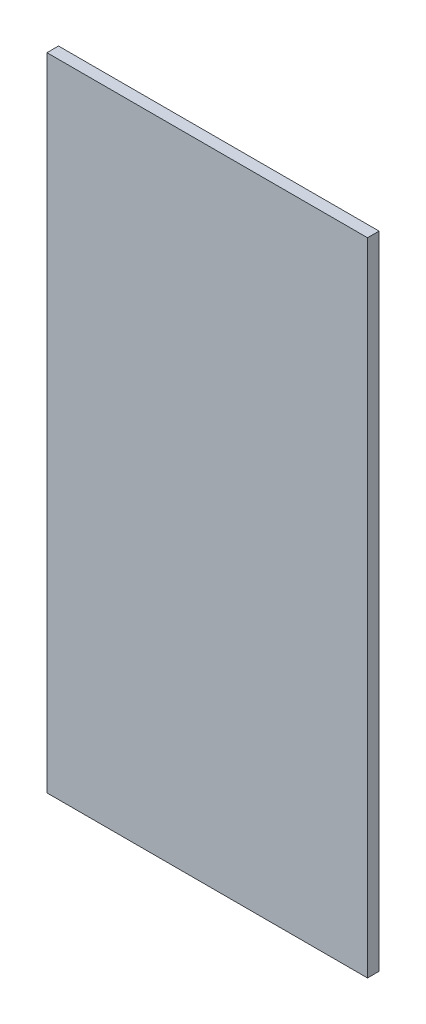
ISO-10303-21;
HEADER;
FILE_DESCRIPTION(('STEP AP214'),'2;1');
FILE_NAME('part.step','',(''),(''),'','','');
FILE_SCHEMA(('AUTOMOTIVE_DESIGN { 1 0 10303 214 1 1 1 1 }'));
ENDSEC;
DATA;
#1=APPLICATION_CONTEXT('core data for automotive mechanical design processes');
#2=APPLICATION_PROTOCOL_DEFINITION('international standard','automotive_design',2000,#1);
#3=PRODUCT_CONTEXT('',#1,'mechanical');
#4=PRODUCT('Part','Part','',(#3));
#5=PRODUCT_RELATED_PRODUCT_CATEGORY('part','',(#4));
#6=PRODUCT_DEFINITION_FORMATION('','',#4);
#7=PRODUCT_DEFINITION_CONTEXT('part definition',#1,'design');
#8=PRODUCT_DEFINITION('design','',#6,#7);
#9=PRODUCT_DEFINITION_SHAPE('','',#8);
#10=(LENGTH_UNIT() NAMED_UNIT(*) SI_UNIT(.MILLI.,.METRE.));
#11=(NAMED_UNIT(*) PLANE_ANGLE_UNIT() SI_UNIT($,.RADIAN.));
#12=(NAMED_UNIT(*) SI_UNIT($,.STERADIAN.) SOLID_ANGLE_UNIT());
#13=UNCERTAINTY_MEASURE_WITH_UNIT(LENGTH_MEASURE(1.E-05),#10,'distance_accuracy_value','');
#14=(GEOMETRIC_REPRESENTATION_CONTEXT(3) GLOBAL_UNCERTAINTY_ASSIGNED_CONTEXT((#13)) GLOBAL_UNIT_ASSIGNED_CONTEXT((#10,
#11,#12)) REPRESENTATION_CONTEXT('',''));
#15=CARTESIAN_POINT('',(0.,0.,0.));
#16=DIRECTION('',(0.,0.,1.));
#17=DIRECTION('',(1.,0.,0.));
#18=AXIS2_PLACEMENT_3D('',#15,#16,#17);
#19=CARTESIAN_POINT('',(-0.375,0.5,-0.018));
#20=DIRECTION('',(1.,0.,0.));
#21=DIRECTION('',(0.,0.,1.));
#22=AXIS2_PLACEMENT_3D('',#19,#20,#21);
#23=PLANE('',#22);
#24=CARTESIAN_POINT('',(-0.375,0.5,-0.018));
#25=CARTESIAN_POINT('',(-0.375,1.5,-0.018));
#26=B_SPLINE_CURVE_WITH_KNOTS('',1,(#24,#25),.UNSPECIFIED.,.F.,.F.,(2,2),(0.,1.),.UNSPECIFIED.);
#27=CARTESIAN_POINT('',(-0.375,0.5,-0.018));
#28=VERTEX_POINT('',#27);
#29=CARTESIAN_POINT('',(-0.375,1.5,-0.018));
#30=VERTEX_POINT('',#29);
#31=EDGE_CURVE('E11',#28,#30,#26,.T.);
#32=ORIENTED_EDGE('',*,*,#31,.T.);
#33=CARTESIAN_POINT('',(-0.375,1.5,-0.018));
#34=CARTESIAN_POINT('',(-0.375,1.5,0.));
#35=B_SPLINE_CURVE_WITH_KNOTS('',1,(#33,#34),.UNSPECIFIED.,.F.,.F.,(2,2),(0.,0.018),.UNSPECIFIED.);
#36=CARTESIAN_POINT('',(-0.375,1.5,0.));
#37=VERTEX_POINT('',#36);
#38=EDGE_CURVE('E26',#30,#37,#35,.T.);
#39=ORIENTED_EDGE('',*,*,#38,.T.);
#40=CARTESIAN_POINT('',(-0.375,0.5,0.));
#41=CARTESIAN_POINT('',(-0.375,1.5,0.));
#42=B_SPLINE_CURVE_WITH_KNOTS('',1,(#40,#41),.UNSPECIFIED.,.F.,.F.,(2,2),(0.,1.),.UNSPECIFIED.);
#43=CARTESIAN_POINT('',(-0.375,0.5,0.));
#44=VERTEX_POINT('',#43);
#45=EDGE_CURVE('E132',#44,#37,#42,.T.);
#46=ORIENTED_EDGE('',*,*,#45,.F.);
#47=CARTESIAN_POINT('',(-0.375,0.5,-0.018));
#48=CARTESIAN_POINT('',(-0.375,0.5,0.));
#49=B_SPLINE_CURVE_WITH_KNOTS('',1,(#47,#48),.UNSPECIFIED.,.F.,.F.,(2,2),(0.,0.018),.UNSPECIFIED.);
#50=EDGE_CURVE('E79',#28,#44,#49,.T.);
#51=ORIENTED_EDGE('',*,*,#50,.F.);
#52=EDGE_LOOP('',(#32,#39,#46,#51));
#53=FACE_BOUND('',#52,.T.);
#54=ADVANCED_FACE('F17',(#53),#23,.T.);
#55=CARTESIAN_POINT('',(-0.375,1.5,-0.018));
#56=DIRECTION('',(0.,1.,0.));
#57=DIRECTION('',(0.,0.,1.));
#58=AXIS2_PLACEMENT_3D('',#55,#56,#57);
#59=PLANE('',#58);
#60=CARTESIAN_POINT('',(-0.375,1.5,-0.018));
#61=CARTESIAN_POINT('',(-0.875,1.5,-0.018));
#62=B_SPLINE_CURVE_WITH_KNOTS('',1,(#60,#61),.UNSPECIFIED.,.F.,.F.,(2,2),(1.,1.5),.UNSPECIFIED.);
#63=CARTESIAN_POINT('',(-0.875,1.5,-0.018));
#64=VERTEX_POINT('',#63);
#65=EDGE_CURVE('E119',#30,#64,#62,.T.);
#66=ORIENTED_EDGE('',*,*,#65,.T.);
#67=CARTESIAN_POINT('',(-0.875,1.5,-0.018));
#68=CARTESIAN_POINT('',(-0.875,1.5,0.));
#69=B_SPLINE_CURVE_WITH_KNOTS('',1,(#67,#68),.UNSPECIFIED.,.F.,.F.,(2,2),(0.,0.018),.UNSPECIFIED.);
#70=CARTESIAN_POINT('',(-0.875,1.5,0.));
#71=VERTEX_POINT('',#70);
#72=EDGE_CURVE('E112',#64,#71,#69,.T.);
#73=ORIENTED_EDGE('',*,*,#72,.T.);
#74=CARTESIAN_POINT('',(-0.375,1.5,0.));
#75=CARTESIAN_POINT('',(-0.875,1.5,0.));
#76=B_SPLINE_CURVE_WITH_KNOTS('',1,(#74,#75),.UNSPECIFIED.,.F.,.F.,(2,2),(1.,1.5),.UNSPECIFIED.);
#77=EDGE_CURVE('E74',#37,#71,#76,.T.);
#78=ORIENTED_EDGE('',*,*,#77,.F.);
#79=ORIENTED_EDGE('',*,*,#38,.F.);
#80=EDGE_LOOP('',(#66,#73,#78,#79));
#81=FACE_BOUND('',#80,.T.);
#82=ADVANCED_FACE('F147',(#81),#59,.T.);
#83=CARTESIAN_POINT('',(-0.875,1.5,-0.018));
#84=DIRECTION('',(-1.,0.,0.));
#85=DIRECTION('',(0.,0.,-1.));
#86=AXIS2_PLACEMENT_3D('',#83,#84,#85);
#87=PLANE('',#86);
#88=CARTESIAN_POINT('',(-0.875,1.5,-0.018));
#89=CARTESIAN_POINT('',(-0.875,0.5,-0.018));
#90=B_SPLINE_CURVE_WITH_KNOTS('',1,(#88,#89),.UNSPECIFIED.,.F.,.F.,(2,2),(1.5,2.5),.UNSPECIFIED.);
#91=CARTESIAN_POINT('',(-0.875,0.5,-0.018));
#92=VERTEX_POINT('',#91);
#93=EDGE_CURVE('E62',#64,#92,#90,.T.);
#94=ORIENTED_EDGE('',*,*,#93,.T.);
#95=CARTESIAN_POINT('',(-0.875,0.5,-0.018));
#96=CARTESIAN_POINT('',(-0.875,0.5,0.));
#97=B_SPLINE_CURVE_WITH_KNOTS('',1,(#95,#96),.UNSPECIFIED.,.F.,.F.,(2,2),(0.,0.018),.UNSPECIFIED.);
#98=CARTESIAN_POINT('',(-0.875,0.5,0.));
#99=VERTEX_POINT('',#98);
#100=EDGE_CURVE('E56',#92,#99,#97,.T.);
#101=ORIENTED_EDGE('',*,*,#100,.T.);
#102=CARTESIAN_POINT('',(-0.875,1.5,0.));
#103=CARTESIAN_POINT('',(-0.875,0.5,0.));
#104=B_SPLINE_CURVE_WITH_KNOTS('',1,(#102,#103),.UNSPECIFIED.,.F.,.F.,(2,2),(1.5,2.5),.UNSPECIFIED.);
#105=EDGE_CURVE('E60',#71,#99,#104,.T.);
#106=ORIENTED_EDGE('',*,*,#105,.F.);
#107=ORIENTED_EDGE('',*,*,#72,.F.);
#108=EDGE_LOOP('',(#94,#101,#106,#107));
#109=FACE_BOUND('',#108,.T.);
#110=ADVANCED_FACE('F58',(#109),#87,.T.);
#111=CARTESIAN_POINT('',(-0.875,0.5,-0.018));
#112=DIRECTION('',(0.,-1.,0.));
#113=DIRECTION('',(0.,0.,-1.));
#114=AXIS2_PLACEMENT_3D('',#111,#112,#113);
#115=PLANE('',#114);
#116=CARTESIAN_POINT('',(-0.875,0.5,-0.018));
#117=CARTESIAN_POINT('',(-0.375,0.5,-0.018));
#118=B_SPLINE_CURVE_WITH_KNOTS('',1,(#116,#117),.UNSPECIFIED.,.F.,.F.,(2,2),(2.5,3.),.UNSPECIFIED.);
#119=EDGE_CURVE('E75',#92,#28,#118,.T.);
#120=ORIENTED_EDGE('',*,*,#119,.T.);
#121=ORIENTED_EDGE('',*,*,#50,.T.);
#122=CARTESIAN_POINT('',(-0.875,0.5,0.));
#123=CARTESIAN_POINT('',(-0.375,0.5,0.));
#124=B_SPLINE_CURVE_WITH_KNOTS('',1,(#122,#123),.UNSPECIFIED.,.F.,.F.,(2,2),(2.5,3.),.UNSPECIFIED.);
#125=EDGE_CURVE('E72',#99,#44,#124,.T.);
#126=ORIENTED_EDGE('',*,*,#125,.F.);
#127=ORIENTED_EDGE('',*,*,#100,.F.);
#128=EDGE_LOOP('',(#120,#121,#126,#127));
#129=FACE_BOUND('',#128,.T.);
#130=ADVANCED_FACE('F78',(#129),#115,.T.);
#131=CARTESIAN_POINT('',(-0.875,0.5,-0.018));
#132=DIRECTION('',(0.,0.,-1.));
#133=DIRECTION('',(-1.,0.,0.));
#134=AXIS2_PLACEMENT_3D('',#131,#132,#133);
#135=PLANE('',#134);
#136=ORIENTED_EDGE('',*,*,#119,.F.);
#137=ORIENTED_EDGE('',*,*,#93,.F.);
#138=ORIENTED_EDGE('',*,*,#65,.F.);
#139=ORIENTED_EDGE('',*,*,#31,.F.);
#140=EDGE_LOOP('',(#136,#137,#138,#139));
#141=FACE_BOUND('',#140,.T.);
#142=ADVANCED_FACE('F148',(#141),#135,.T.);
#143=CARTESIAN_POINT('',(-0.875,0.5,0.));
#144=DIRECTION('',(0.,0.,1.));
#145=DIRECTION('',(1.,0.,0.));
#146=AXIS2_PLACEMENT_3D('',#143,#144,#145);
#147=PLANE('',#146);
#148=ORIENTED_EDGE('',*,*,#45,.T.);
#149=ORIENTED_EDGE('',*,*,#77,.T.);
#150=ORIENTED_EDGE('',*,*,#105,.T.);
#151=ORIENTED_EDGE('',*,*,#125,.T.);
#152=EDGE_LOOP('',(#148,#149,#150,#151));
#153=FACE_BOUND('',#152,.T.);
#154=ADVANCED_FACE('F71',(#153),#147,.T.);
#155=CLOSED_SHELL('',(#54,#82,#110,#130,#142,#154));
#156=MANIFOLD_SOLID_BREP('B1',#155);
#157=ADVANCED_BREP_SHAPE_REPRESENTATION('',(#18,#156),#14);
#158=SHAPE_DEFINITION_REPRESENTATION(#9,#157);
ENDSEC;
END-ISO-10303-21;
